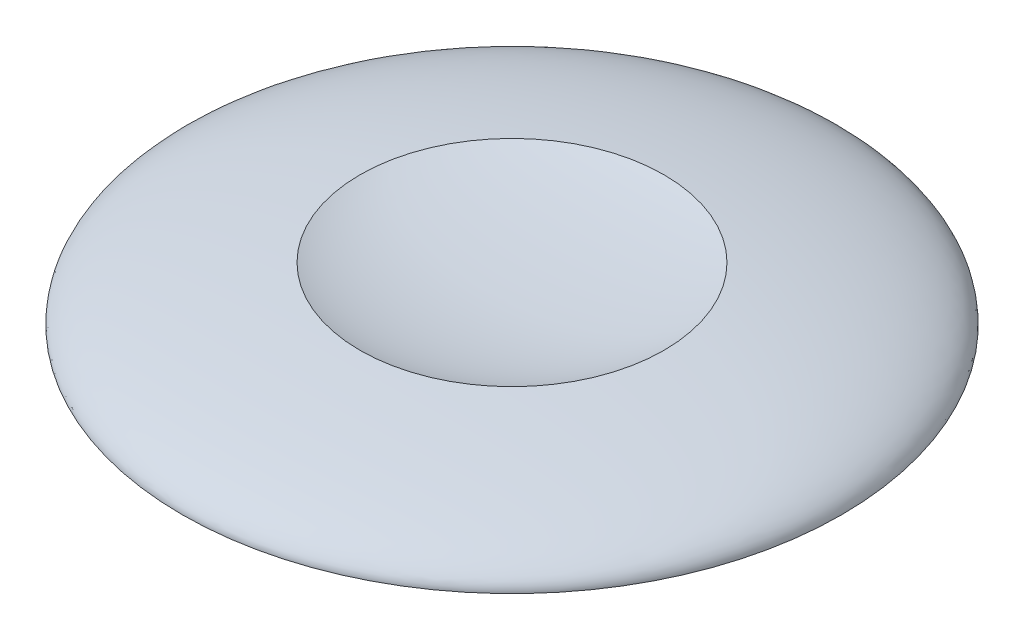
ISO-10303-21;
HEADER;
FILE_DESCRIPTION(('STEP AP214'),'2;1');
FILE_NAME('part.step','',(''),(''),'','','');
FILE_SCHEMA(('AUTOMOTIVE_DESIGN { 1 0 10303 214 1 1 1 1 }'));
ENDSEC;
DATA;
#1=APPLICATION_CONTEXT('core data for automotive mechanical design processes');
#2=APPLICATION_PROTOCOL_DEFINITION('international standard','automotive_design',2000,#1);
#3=PRODUCT_CONTEXT('',#1,'mechanical');
#4=PRODUCT('Part','Part','',(#3));
#5=PRODUCT_RELATED_PRODUCT_CATEGORY('part','',(#4));
#6=PRODUCT_DEFINITION_FORMATION('','',#4);
#7=PRODUCT_DEFINITION_CONTEXT('part definition',#1,'design');
#8=PRODUCT_DEFINITION('design','',#6,#7);
#9=PRODUCT_DEFINITION_SHAPE('','',#8);
#10=(LENGTH_UNIT() NAMED_UNIT(*) SI_UNIT(.MILLI.,.METRE.));
#11=(NAMED_UNIT(*) PLANE_ANGLE_UNIT() SI_UNIT($,.RADIAN.));
#12=(NAMED_UNIT(*) SI_UNIT($,.STERADIAN.) SOLID_ANGLE_UNIT());
#13=UNCERTAINTY_MEASURE_WITH_UNIT(LENGTH_MEASURE(1.E-05),#10,'distance_accuracy_value','');
#14=(GEOMETRIC_REPRESENTATION_CONTEXT(3) GLOBAL_UNCERTAINTY_ASSIGNED_CONTEXT((#13)) GLOBAL_UNIT_ASSIGNED_CONTEXT((#10,
#11,#12)) REPRESENTATION_CONTEXT('',''));
#15=CARTESIAN_POINT('',(0.,0.,0.));
#16=DIRECTION('',(0.,0.,1.));
#17=DIRECTION('',(1.,0.,0.));
#18=AXIS2_PLACEMENT_3D('',#15,#16,#17);
#19=CARTESIAN_POINT('',(0.,0.,0.));
#20=DIRECTION('',(1.,0.,0.));
#21=DIRECTION('',(0.,0.,-1.));
#22=AXIS2_PLACEMENT_3D('',#19,#20,#21);
#23=ELLIPSE('',#22,5.,0.916198026444761);
#24=TRIMMED_CURVE('',#23,(PARAMETER_VALUE(-1.5707963267949)),(PARAMETER_VALUE(1.5707963267949)),
.T.,.PARAMETER.);
#25=CARTESIAN_POINT('',(0.,0.511437147698112,0.));
#26=DIRECTION('',(0.,1.,0.));
#27=AXIS1_PLACEMENT('',#25,#26);
#28=SURFACE_OF_REVOLUTION('',#24,#27);
#29=CARTESIAN_POINT('',(0.,0.812981859817892,0.));
#30=DIRECTION('',(0.,1.,0.));
#31=DIRECTION('',(0.,0.,1.));
#32=AXIS2_PLACEMENT_3D('',#29,#30,#31);
#33=CIRCLE('',#32,2.30555030635039);
#34=CARTESIAN_POINT('',(0.,0.812981859817891,2.30555030635039));
#35=VERTEX_POINT('',#34);
#36=EDGE_CURVE('E11',#35,#35,#33,.T.);
#37=ORIENTED_EDGE('',*,*,#36,.F.);
#38=EDGE_LOOP('',(#37));
#39=FACE_BOUND('',#38,.T.);
#40=CARTESIAN_POINT('',(0.,0.,0.));
#41=DIRECTION('',(0.,1.,0.));
#42=DIRECTION('',(0.,0.,1.));
#43=AXIS2_PLACEMENT_3D('',#40,#41,#42);
#44=CIRCLE('',#43,5.);
#45=CARTESIAN_POINT('',(0.,0.,5.));
#46=VERTEX_POINT('',#45);
#47=EDGE_CURVE('E56',#46,#46,#44,.T.);
#48=ORIENTED_EDGE('',*,*,#47,.T.);
#49=EDGE_LOOP('',(#48));
#50=FACE_BOUND('',#49,.T.);
#51=ADVANCED_FACE('F36',(#39,#50),#28,.T.);
#52=CARTESIAN_POINT('',(0.,1.14179780694032,0.));
#53=DIRECTION('',(-1.,0.,0.));
#54=DIRECTION('',(0.,0.,-1.));
#55=AXIS2_PLACEMENT_3D('',#52,#53,#54);
#56=ELLIPSE('',#55,2.70233108069451,0.630360659242204);
#57=TRIMMED_CURVE('',#56,(PARAMETER_VALUE(-1.5707963267949)),(PARAMETER_VALUE(1.5707963267949)),
.T.,.PARAMETER.);
#58=CARTESIAN_POINT('',(0.,0.511437147698112,0.));
#59=DIRECTION('',(0.,1.,0.));
#60=AXIS1_PLACEMENT('',#58,#59);
#61=SURFACE_OF_REVOLUTION('',#57,#60);
#62=CARTESIAN_POINT('',(0.,0.511437147698112,0.));
#63=VERTEX_POINT('',#62);
#64=VERTEX_LOOP('',#63);
#65=FACE_BOUND('',#64,.T.);
#66=ORIENTED_EDGE('',*,*,#36,.T.);
#67=EDGE_LOOP('',(#66));
#68=FACE_BOUND('',#67,.T.);
#69=ADVANCED_FACE('F46',(#65,#68),#61,.T.);
#70=CARTESIAN_POINT('',(0.,-3.,0.));
#71=DIRECTION('',(0.,1.,0.));
#72=DIRECTION('',(0.,0.,1.));
#73=AXIS2_PLACEMENT_3D('',#70,#71,#72);
#74=PLANE('',#73);
#75=CARTESIAN_POINT('',(0.,-3.,0.));
#76=DIRECTION('',(0.,1.,0.));
#77=DIRECTION('',(0.,0.,1.));
#78=AXIS2_PLACEMENT_3D('',#75,#76,#77);
#79=CIRCLE('',#78,0.6);
#80=CARTESIAN_POINT('',(0.,-3.,0.599999999999999));
#81=VERTEX_POINT('',#80);
#82=EDGE_CURVE('E43',#81,#81,#79,.T.);
#83=ORIENTED_EDGE('',*,*,#82,.F.);
#84=EDGE_LOOP('',(#83));
#85=FACE_BOUND('',#84,.T.);
#86=ADVANCED_FACE('F49',(#85),#74,.F.);
#87=CARTESIAN_POINT('',(0.,-2.9,0.));
#88=DIRECTION('',(0.,1.,0.));
#89=DIRECTION('',(0.,0.,1.));
#90=AXIS2_PLACEMENT_3D('',#87,#88,#89);
#91=TOROIDAL_SURFACE('',#90,0.6,0.0999999999999999);
#92=CARTESIAN_POINT('',(0.,-2.9,0.));
#93=DIRECTION('',(0.,1.,0.));
#94=DIRECTION('',(0.,0.,1.));
#95=AXIS2_PLACEMENT_3D('',#92,#93,#94);
#96=CIRCLE('',#95,0.7);
#97=CARTESIAN_POINT('',(0.,-2.9,0.699999999999999));
#98=VERTEX_POINT('',#97);
#99=EDGE_CURVE('E71',#98,#98,#96,.T.);
#100=ORIENTED_EDGE('',*,*,#99,.F.);
#101=EDGE_LOOP('',(#100));
#102=FACE_BOUND('',#101,.T.);
#103=ORIENTED_EDGE('',*,*,#82,.T.);
#104=EDGE_LOOP('',(#103));
#105=FACE_BOUND('',#104,.T.);
#106=ADVANCED_FACE('F76',(#102,#105),#91,.T.);
#107=CARTESIAN_POINT('',(0.,0.511437147698112,0.));
#108=DIRECTION('',(0.,1.,0.));
#109=DIRECTION('',(0.,0.,1.));
#110=AXIS2_PLACEMENT_3D('',#107,#108,#109);
#111=CYLINDRICAL_SURFACE('',#110,0.7);
#112=CARTESIAN_POINT('',(0.,-0.0999999999999999,0.));
#113=DIRECTION('',(0.,1.,0.));
#114=DIRECTION('',(0.,0.,1.));
#115=AXIS2_PLACEMENT_3D('',#112,#113,#114);
#116=CIRCLE('',#115,0.7);
#117=CARTESIAN_POINT('',(0.,-0.1,0.7));
#118=VERTEX_POINT('',#117);
#119=EDGE_CURVE('E68',#118,#118,#116,.T.);
#120=ORIENTED_EDGE('',*,*,#119,.F.);
#121=EDGE_LOOP('',(#120));
#122=FACE_BOUND('',#121,.T.);
#123=ORIENTED_EDGE('',*,*,#99,.T.);
#124=EDGE_LOOP('',(#123));
#125=FACE_BOUND('',#124,.T.);
#126=ADVANCED_FACE('F83',(#122,#125),#111,.T.);
#127=CARTESIAN_POINT('',(0.,-0.1,-0.7));
#128=DIRECTION('',(0.,1.,0.));
#129=DIRECTION('',(0.,0.,1.));
#130=AXIS2_PLACEMENT_3D('',#127,#128,#129);
#131=PLANE('',#130);
#132=CARTESIAN_POINT('',(0.,-0.1,0.));
#133=DIRECTION('',(0.,1.,0.));
#134=DIRECTION('',(0.,0.,1.));
#135=AXIS2_PLACEMENT_3D('',#132,#133,#134);
#136=CIRCLE('',#135,1.7);
#137=CARTESIAN_POINT('',(0.,-0.100000000000001,1.7));
#138=VERTEX_POINT('',#137);
#139=EDGE_CURVE('E61',#138,#138,#136,.T.);
#140=ORIENTED_EDGE('',*,*,#139,.F.);
#141=EDGE_LOOP('',(#140));
#142=FACE_BOUND('',#141,.T.);
#143=ORIENTED_EDGE('',*,*,#119,.T.);
#144=EDGE_LOOP('',(#143));
#145=FACE_BOUND('',#144,.T.);
#146=ADVANCED_FACE('F89',(#142,#145),#131,.F.);
#147=CARTESIAN_POINT('',(0.,0.511437147698112,0.));
#148=DIRECTION('',(0.,1.,0.));
#149=DIRECTION('',(0.,0.,1.));
#150=AXIS2_PLACEMENT_3D('',#147,#148,#149);
#151=CYLINDRICAL_SURFACE('',#150,1.7);
#152=CARTESIAN_POINT('',(0.,0.,0.));
#153=DIRECTION('',(0.,1.,0.));
#154=DIRECTION('',(0.,0.,1.));
#155=AXIS2_PLACEMENT_3D('',#152,#153,#154);
#156=CIRCLE('',#155,1.7);
#157=CARTESIAN_POINT('',(0.,0.,1.7));
#158=VERTEX_POINT('',#157);
#159=EDGE_CURVE('E58',#158,#158,#156,.T.);
#160=ORIENTED_EDGE('',*,*,#159,.F.);
#161=EDGE_LOOP('',(#160));
#162=FACE_BOUND('',#161,.T.);
#163=ORIENTED_EDGE('',*,*,#139,.T.);
#164=EDGE_LOOP('',(#163));
#165=FACE_BOUND('',#164,.T.);
#166=ADVANCED_FACE('F93',(#162,#165),#151,.T.);
#167=CARTESIAN_POINT('',(0.,0.,-1.7));
#168=DIRECTION('',(0.,1.,0.));
#169=DIRECTION('',(0.,0.,1.));
#170=AXIS2_PLACEMENT_3D('',#167,#168,#169);
#171=PLANE('',#170);
#172=ORIENTED_EDGE('',*,*,#47,.F.);
#173=EDGE_LOOP('',(#172));
#174=FACE_BOUND('',#173,.T.);
#175=ORIENTED_EDGE('',*,*,#159,.T.);
#176=EDGE_LOOP('',(#175));
#177=FACE_BOUND('',#176,.T.);
#178=ADVANCED_FACE('F97',(#174,#177),#171,.F.);
#179=CLOSED_SHELL('',(#51,#69,#86,#106,#126,#146,#166,#178));
#180=MANIFOLD_SOLID_BREP('B2',#179);
#181=ADVANCED_BREP_SHAPE_REPRESENTATION('',(#18,#180),#14);
#182=SHAPE_DEFINITION_REPRESENTATION(#9,#181);
ENDSEC;
END-ISO-10303-21;
